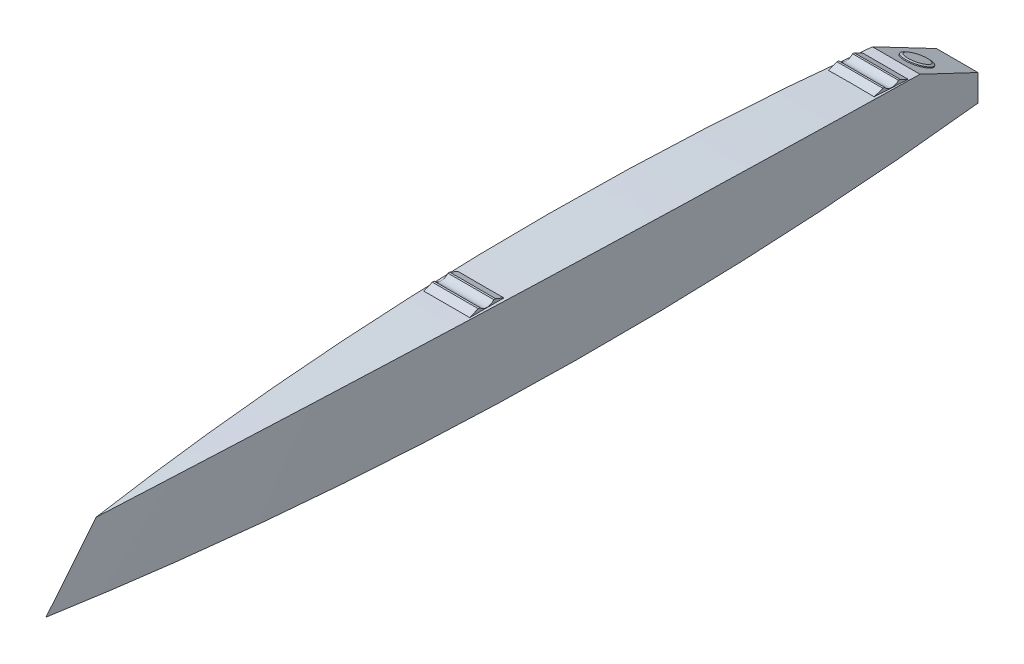
ISO-10303-21;
HEADER;
FILE_DESCRIPTION(('STEP AP214'),'2;1');
FILE_NAME('part.step','',(''),(''),'','','');
FILE_SCHEMA(('AUTOMOTIVE_DESIGN { 1 0 10303 214 1 1 1 1 }'));
ENDSEC;
DATA;
#1=APPLICATION_CONTEXT('core data for automotive mechanical design processes');
#2=APPLICATION_PROTOCOL_DEFINITION('international standard','automotive_design',2000,#1);
#3=PRODUCT_CONTEXT('',#1,'mechanical');
#4=PRODUCT('Part','Part','',(#3));
#5=PRODUCT_RELATED_PRODUCT_CATEGORY('part','',(#4));
#6=PRODUCT_DEFINITION_FORMATION('','',#4);
#7=PRODUCT_DEFINITION_CONTEXT('part definition',#1,'design');
#8=PRODUCT_DEFINITION('design','',#6,#7);
#9=PRODUCT_DEFINITION_SHAPE('','',#8);
#10=(LENGTH_UNIT() NAMED_UNIT(*) SI_UNIT(.MILLI.,.METRE.));
#11=(NAMED_UNIT(*) PLANE_ANGLE_UNIT() SI_UNIT($,.RADIAN.));
#12=(NAMED_UNIT(*) SI_UNIT($,.STERADIAN.) SOLID_ANGLE_UNIT());
#13=UNCERTAINTY_MEASURE_WITH_UNIT(LENGTH_MEASURE(1.E-05),#10,'distance_accuracy_value','');
#14=(GEOMETRIC_REPRESENTATION_CONTEXT(3) GLOBAL_UNCERTAINTY_ASSIGNED_CONTEXT((#13)) GLOBAL_UNIT_ASSIGNED_CONTEXT((#10,
#11,#12)) REPRESENTATION_CONTEXT('',''));
#15=CARTESIAN_POINT('',(0.,0.,0.));
#16=DIRECTION('',(0.,0.,1.));
#17=DIRECTION('',(1.,0.,0.));
#18=AXIS2_PLACEMENT_3D('',#15,#16,#17);
#19=CARTESIAN_POINT('',(130.,452.000000000002,-2367.2199674094));
#20=DIRECTION('',(-1.,0.,0.));
#21=DIRECTION('',(0.,0.,1.));
#22=AXIS2_PLACEMENT_3D('',#19,#20,#21);
#23=CYLINDRICAL_SURFACE('',#22,50.9999999999999);
#24=CARTESIAN_POINT('',(-130.,452.000000000002,-2367.2199674094));
#25=DIRECTION('',(-1.,0.,0.));
#26=DIRECTION('',(0.,0.,-1.));
#27=AXIS2_PLACEMENT_3D('',#24,#25,#26);
#28=CIRCLE('',#27,50.9999999999999);
#29=CARTESIAN_POINT('',(-130.,419.413616232792,-2406.45168408069));
#30=VERTEX_POINT('',#29);
#31=CARTESIAN_POINT('',(-130.,419.505404729545,-2327.9121911023));
#32=VERTEX_POINT('',#31);
#33=EDGE_CURVE('E154',#30,#32,#28,.T.);
#34=ORIENTED_EDGE('',*,*,#33,.T.);
#35=DIRECTION('',(-1.,0.,0.));
#36=VECTOR('',#35,1.);
#37=CARTESIAN_POINT('',(130.,419.505404729545,-2327.9121911023));
#38=LINE('',#37,#36);
#39=CARTESIAN_POINT('',(130.,419.505404729545,-2327.9121911023));
#40=VERTEX_POINT('',#39);
#41=EDGE_CURVE('E12',#40,#32,#38,.T.);
#42=ORIENTED_EDGE('',*,*,#41,.F.);
#43=CARTESIAN_POINT('',(130.,452.000000000002,-2367.2199674094));
#44=DIRECTION('',(-1.,0.,0.));
#45=DIRECTION('',(0.,0.,-1.));
#46=AXIS2_PLACEMENT_3D('',#43,#44,#45);
#47=CIRCLE('',#46,50.9999999999999);
#48=CARTESIAN_POINT('',(130.,419.413616232792,-2406.45168408069));
#49=VERTEX_POINT('',#48);
#50=EDGE_CURVE('E168',#49,#40,#47,.T.);
#51=ORIENTED_EDGE('',*,*,#50,.F.);
#52=DIRECTION('',(-1.,0.,0.));
#53=VECTOR('',#52,1.);
#54=CARTESIAN_POINT('',(130.,419.413616232792,-2406.45168408069));
#55=LINE('',#54,#53);
#56=EDGE_CURVE('E150',#49,#30,#55,.T.);
#57=ORIENTED_EDGE('',*,*,#56,.T.);
#58=EDGE_LOOP('',(#34,#42,#51,#57));
#59=FACE_BOUND('',#58,.T.);
#60=ADVANCED_FACE('F58',(#59),#23,.F.);
#61=CARTESIAN_POINT('',(130.,419.505404729545,-2327.9121911023));
#62=DIRECTION('',(0.,-0.999999317079912,0.00116869145196931));
#63=DIRECTION('',(0.,-0.00116869145196931,-0.999999317079912));
#64=AXIS2_PLACEMENT_3D('',#61,#62,#63);
#65=PLANE('',#64);
#66=DIRECTION('',(0.,0.00116869145196931,0.999999317079912));
#67=VECTOR('',#66,1.);
#68=CARTESIAN_POINT('',(-130.,419.505404729545,-2327.9121911023));
#69=LINE('',#68,#67);
#70=CARTESIAN_POINT('',(-130.,419.517091644065,-2317.9121979315));
#71=VERTEX_POINT('',#70);
#72=EDGE_CURVE('E157',#32,#71,#69,.T.);
#73=ORIENTED_EDGE('',*,*,#72,.T.);
#74=DIRECTION('',(-1.,0.,0.));
#75=VECTOR('',#74,1.);
#76=CARTESIAN_POINT('',(130.,419.517091644065,-2317.9121979315));
#77=LINE('',#76,#75);
#78=CARTESIAN_POINT('',(130.,419.517091644065,-2317.9121979315));
#79=VERTEX_POINT('',#78);
#80=EDGE_CURVE('E66',#79,#71,#77,.T.);
#81=ORIENTED_EDGE('',*,*,#80,.F.);
#82=DIRECTION('',(0.,0.00116869145196931,0.999999317079912));
#83=VECTOR('',#82,1.);
#84=CARTESIAN_POINT('',(130.,419.505404729545,-2327.9121911023));
#85=LINE('',#84,#83);
#86=EDGE_CURVE('E117',#40,#79,#85,.T.);
#87=ORIENTED_EDGE('',*,*,#86,.F.);
#88=ORIENTED_EDGE('',*,*,#41,.T.);
#89=EDGE_LOOP('',(#73,#81,#87,#88));
#90=FACE_BOUND('',#89,.T.);
#91=ADVANCED_FACE('F203',(#90),#65,.F.);
#92=CARTESIAN_POINT('',(130.,419.517091644065,-2317.9121979315));
#93=DIRECTION('',(0.,-0.925955656220427,-0.377632258570953));
#94=DIRECTION('',(0.,0.377632258570953,-0.925955656220427));
#95=AXIS2_PLACEMENT_3D('',#92,#93,#94);
#96=PLANE('',#95);
#97=DIRECTION('',(0.,-0.377632258570953,0.925955656220427));
#98=VECTOR('',#97,1.);
#99=CARTESIAN_POINT('',(-130.,419.517091644065,-2317.9121979315));
#100=LINE('',#99,#98);
#101=CARTESIAN_POINT('',(-130.,398.507173378865,-2266.39580278028));
#102=VERTEX_POINT('',#101);
#103=EDGE_CURVE('E159',#71,#102,#100,.T.);
#104=ORIENTED_EDGE('',*,*,#103,.T.);
#105=DIRECTION('',(-1.,0.,0.));
#106=VECTOR('',#105,1.);
#107=CARTESIAN_POINT('',(130.,398.507173378865,-2266.39580278028));
#108=LINE('',#107,#106);
#109=CARTESIAN_POINT('',(130.,398.507173378865,-2266.39580278028));
#110=VERTEX_POINT('',#109);
#111=EDGE_CURVE('E175',#110,#102,#108,.T.);
#112=ORIENTED_EDGE('',*,*,#111,.F.);
#113=DIRECTION('',(0.,-0.377632258570953,0.925955656220427));
#114=VECTOR('',#113,1.);
#115=CARTESIAN_POINT('',(130.,419.517091644065,-2317.9121979315));
#116=LINE('',#115,#114);
#117=EDGE_CURVE('E183',#79,#110,#116,.T.);
#118=ORIENTED_EDGE('',*,*,#117,.F.);
#119=ORIENTED_EDGE('',*,*,#80,.T.);
#120=EDGE_LOOP('',(#104,#112,#118,#119));
#121=FACE_BOUND('',#120,.T.);
#122=ADVANCED_FACE('F181',(#121),#96,.F.);
#123=CARTESIAN_POINT('',(130.,398.507173378865,-2266.39580278028));
#124=DIRECTION('',(0.,-0.00116869145155625,-0.999999317079912));
#125=DIRECTION('',(0.,0.999999317079913,-0.00116869145155625));
#126=AXIS2_PLACEMENT_3D('',#123,#124,#125);
#127=PLANE('',#126);
#128=DIRECTION('',(0.,-0.999999317079912,0.00116869145155625));
#129=VECTOR('',#128,1.);
#130=CARTESIAN_POINT('',(-130.,398.507173378865,-2266.39580278028));
#131=LINE('',#130,#129);
#132=CARTESIAN_POINT('',(-130.,393.515237661271,-2266.38996874369));
#133=VERTEX_POINT('',#132);
#134=EDGE_CURVE('E161',#102,#133,#131,.T.);
#135=ORIENTED_EDGE('',*,*,#134,.T.);
#136=DIRECTION('',(-1.,0.,0.));
#137=VECTOR('',#136,1.);
#138=CARTESIAN_POINT('',(130.,393.515237661271,-2266.38996874369));
#139=LINE('',#138,#137);
#140=CARTESIAN_POINT('',(130.,393.515237661271,-2266.38996874369));
#141=VERTEX_POINT('',#140);
#142=EDGE_CURVE('E172',#141,#133,#139,.T.);
#143=ORIENTED_EDGE('',*,*,#142,.F.);
#144=DIRECTION('',(0.,-0.999999317079912,0.00116869145155625));
#145=VECTOR('',#144,1.);
#146=CARTESIAN_POINT('',(130.,398.507173378865,-2266.39580278028));
#147=LINE('',#146,#145);
#148=EDGE_CURVE('E195',#110,#141,#147,.T.);
#149=ORIENTED_EDGE('',*,*,#148,.F.);
#150=ORIENTED_EDGE('',*,*,#111,.T.);
#151=EDGE_LOOP('',(#135,#143,#149,#150));
#152=FACE_BOUND('',#151,.T.);
#153=ADVANCED_FACE('F191',(#152),#127,.F.);
#154=CARTESIAN_POINT('',(130.,393.515237661271,-2266.38996874369));
#155=DIRECTION('',(0.,0.999999317079912,-0.00116869145197068));
#156=DIRECTION('',(0.,0.00116869145197068,0.999999317079912));
#157=AXIS2_PLACEMENT_3D('',#154,#155,#156);
#158=PLANE('',#157);
#159=DIRECTION('',(0.,-0.00116869145197068,-0.999999317079912));
#160=VECTOR('',#159,1.);
#161=CARTESIAN_POINT('',(-130.,393.515237661271,-2266.38996874369));
#162=LINE('',#161,#160);
#163=CARTESIAN_POINT('',(-130.,393.281499370877,-2466.38983215968));
#164=VERTEX_POINT('',#163);
#165=EDGE_CURVE('E163',#133,#164,#162,.T.);
#166=ORIENTED_EDGE('',*,*,#165,.T.);
#167=DIRECTION('',(-1.,0.,0.));
#168=VECTOR('',#167,1.);
#169=CARTESIAN_POINT('',(130.,393.281499370877,-2466.38983215968));
#170=LINE('',#169,#168);
#171=CARTESIAN_POINT('',(130.,393.281499370877,-2466.38983215968));
#172=VERTEX_POINT('',#171);
#173=EDGE_CURVE('E145',#172,#164,#170,.T.);
#174=ORIENTED_EDGE('',*,*,#173,.F.);
#175=DIRECTION('',(0.,-0.00116869145197068,-0.999999317079912));
#176=VECTOR('',#175,1.);
#177=CARTESIAN_POINT('',(130.,393.515237661271,-2266.38996874369));
#178=LINE('',#177,#176);
#179=EDGE_CURVE('E136',#141,#172,#178,.T.);
#180=ORIENTED_EDGE('',*,*,#179,.F.);
#181=ORIENTED_EDGE('',*,*,#142,.T.);
#182=EDGE_LOOP('',(#166,#174,#180,#181));
#183=FACE_BOUND('',#182,.T.);
#184=ADVANCED_FACE('F194',(#183),#158,.F.);
#185=CARTESIAN_POINT('',(130.,398.273435088473,-2466.39566619626));
#186=DIRECTION('',(0.,0.00116869145200072,0.999999317079912));
#187=DIRECTION('',(0.,-0.999999317079912,0.00116869145200072));
#188=AXIS2_PLACEMENT_3D('',#185,#186,#187);
#189=PLANE('',#188);
#190=DIRECTION('',(0.,0.999999317079912,-0.00116869145200072));
#191=VECTOR('',#190,1.);
#192=CARTESIAN_POINT('',(-130.,398.273435088473,-2466.39566619626));
#193=LINE('',#192,#191);
#194=CARTESIAN_POINT('',(-130.,398.273435088473,-2466.39566619626));
#195=VERTEX_POINT('',#194);
#196=EDGE_CURVE('E144',#164,#195,#193,.T.);
#197=ORIENTED_EDGE('',*,*,#196,.T.);
#198=DIRECTION('',(-1.,0.,0.));
#199=VECTOR('',#198,1.);
#200=CARTESIAN_POINT('',(130.,398.273435088473,-2466.39566619626));
#201=LINE('',#200,#199);
#202=CARTESIAN_POINT('',(130.,398.273435088473,-2466.39566619626));
#203=VERTEX_POINT('',#202);
#204=EDGE_CURVE('E141',#203,#195,#201,.T.);
#205=ORIENTED_EDGE('',*,*,#204,.F.);
#206=DIRECTION('',(0.,0.999999317079912,-0.00116869145200072));
#207=VECTOR('',#206,1.);
#208=CARTESIAN_POINT('',(130.,398.273435088473,-2466.39566619626));
#209=LINE('',#208,#207);
#210=EDGE_CURVE('E130',#172,#203,#209,.T.);
#211=ORIENTED_EDGE('',*,*,#210,.F.);
#212=ORIENTED_EDGE('',*,*,#173,.T.);
#213=EDGE_LOOP('',(#197,#205,#211,#212));
#214=FACE_BOUND('',#213,.T.);
#215=ADVANCED_FACE('F142',(#214),#189,.F.);
#216=CARTESIAN_POINT('',(130.,419.401909645947,-2416.46851001997));
#217=DIRECTION('',(0.,-0.920931193328839,0.389725207234432));
#218=DIRECTION('',(0.,-0.389725207234432,-0.920931193328839));
#219=AXIS2_PLACEMENT_3D('',#216,#217,#218);
#220=PLANE('',#219);
#221=DIRECTION('',(0.,0.389725207234432,0.920931193328839));
#222=VECTOR('',#221,1.);
#223=CARTESIAN_POINT('',(-130.,419.401909645947,-2416.46851001997));
#224=LINE('',#223,#222);
#225=CARTESIAN_POINT('',(-130.,419.401909645947,-2416.46851001997));
#226=VERTEX_POINT('',#225);
#227=EDGE_CURVE('E103',#195,#226,#224,.T.);
#228=ORIENTED_EDGE('',*,*,#227,.T.);
#229=DIRECTION('',(-1.,0.,0.));
#230=VECTOR('',#229,1.);
#231=CARTESIAN_POINT('',(130.,419.401909645947,-2416.46851001997));
#232=LINE('',#231,#230);
#233=CARTESIAN_POINT('',(130.,419.401909645947,-2416.46851001997));
#234=VERTEX_POINT('',#233);
#235=EDGE_CURVE('E146',#234,#226,#232,.T.);
#236=ORIENTED_EDGE('',*,*,#235,.F.);
#237=DIRECTION('',(0.,0.389725207234432,0.920931193328839));
#238=VECTOR('',#237,1.);
#239=CARTESIAN_POINT('',(130.,419.401909645947,-2416.46851001997));
#240=LINE('',#239,#238);
#241=EDGE_CURVE('E134',#203,#234,#240,.T.);
#242=ORIENTED_EDGE('',*,*,#241,.F.);
#243=ORIENTED_EDGE('',*,*,#204,.T.);
#244=EDGE_LOOP('',(#228,#236,#242,#243));
#245=FACE_BOUND('',#244,.T.);
#246=ADVANCED_FACE('F148',(#245),#220,.F.);
#247=CARTESIAN_POINT('',(130.,419.413616232792,-2406.45168408069));
#248=DIRECTION('',(0.,-0.999999317079912,0.00116869145197264));
#249=DIRECTION('',(0.,-0.00116869145197264,-0.999999317079912));
#250=AXIS2_PLACEMENT_3D('',#247,#248,#249);
#251=PLANE('',#250);
#252=DIRECTION('',(0.,0.00116869145197264,0.999999317079912));
#253=VECTOR('',#252,1.);
#254=CARTESIAN_POINT('',(-130.,419.413616232792,-2406.45168408069));
#255=LINE('',#254,#253);
#256=EDGE_CURVE('E109',#226,#30,#255,.T.);
#257=ORIENTED_EDGE('',*,*,#256,.T.);
#258=ORIENTED_EDGE('',*,*,#56,.F.);
#259=DIRECTION('',(0.,0.00116869145197264,0.999999317079912));
#260=VECTOR('',#259,1.);
#261=CARTESIAN_POINT('',(130.,419.413616232792,-2406.45168408069));
#262=LINE('',#261,#260);
#263=EDGE_CURVE('E74',#234,#49,#262,.T.);
#264=ORIENTED_EDGE('',*,*,#263,.F.);
#265=ORIENTED_EDGE('',*,*,#235,.T.);
#266=EDGE_LOOP('',(#257,#258,#264,#265));
#267=FACE_BOUND('',#266,.T.);
#268=ADVANCED_FACE('F219',(#267),#251,.F.);
#269=CARTESIAN_POINT('',(130.,452.000000000002,-2367.2199674094));
#270=DIRECTION('',(1.,0.,0.));
#271=DIRECTION('',(0.,0.,-1.));
#272=AXIS2_PLACEMENT_3D('',#269,#270,#271);
#273=PLANE('',#272);
#274=ORIENTED_EDGE('',*,*,#50,.T.);
#275=ORIENTED_EDGE('',*,*,#86,.T.);
#276=ORIENTED_EDGE('',*,*,#117,.T.);
#277=ORIENTED_EDGE('',*,*,#148,.T.);
#278=ORIENTED_EDGE('',*,*,#179,.T.);
#279=ORIENTED_EDGE('',*,*,#210,.T.);
#280=ORIENTED_EDGE('',*,*,#241,.T.);
#281=ORIENTED_EDGE('',*,*,#263,.T.);
#282=EDGE_LOOP('',(#274,#275,#276,#277,#278,#279,#280,#281));
#283=FACE_BOUND('',#282,.T.);
#284=ADVANCED_FACE('F132',(#283),#273,.T.);
#285=CARTESIAN_POINT('',(-130.,452.000000000002,-2367.2199674094));
#286=DIRECTION('',(1.,0.,0.));
#287=DIRECTION('',(0.,0.,-1.));
#288=AXIS2_PLACEMENT_3D('',#285,#286,#287);
#289=PLANE('',#288);
#290=ORIENTED_EDGE('',*,*,#33,.F.);
#291=ORIENTED_EDGE('',*,*,#256,.F.);
#292=ORIENTED_EDGE('',*,*,#227,.F.);
#293=ORIENTED_EDGE('',*,*,#196,.F.);
#294=ORIENTED_EDGE('',*,*,#165,.F.);
#295=ORIENTED_EDGE('',*,*,#134,.F.);
#296=ORIENTED_EDGE('',*,*,#103,.F.);
#297=ORIENTED_EDGE('',*,*,#72,.F.);
#298=EDGE_LOOP('',(#290,#291,#292,#293,#294,#295,#296,#297));
#299=FACE_BOUND('',#298,.T.);
#300=ADVANCED_FACE('F187',(#299),#289,.F.);
#301=CLOSED_SHELL('',(#60,#91,#122,#153,#184,#215,#246,#268,#284,#300));
#302=MANIFOLD_SOLID_BREP('B2',#301);
#303=CARTESIAN_POINT('',(130.,384.135187442793,-4661.2163421268));
#304=DIRECTION('',(-1.,0.,0.));
#305=DIRECTION('',(0.,0.,1.));
#306=AXIS2_PLACEMENT_3D('',#303,#304,#305);
#307=CYLINDRICAL_SURFACE('',#306,51.);
#308=CARTESIAN_POINT('',(-130.,384.135187442793,-4661.2163421268));
#309=DIRECTION('',(-1.,0.,0.));
#310=DIRECTION('',(0.,0.,-1.));
#311=AXIS2_PLACEMENT_3D('',#308,#309,#310);
#312=CIRCLE('',#311,51.);
#313=CARTESIAN_POINT('',(-130.,349.373718303237,-4698.53443778105));
#314=VERTEX_POINT('',#313);
#315=CARTESIAN_POINT('',(-130.,353.924998461992,-4620.12687289508));
#316=VERTEX_POINT('',#315);
#317=EDGE_CURVE('E371',#314,#316,#312,.T.);
#318=ORIENTED_EDGE('',*,*,#317,.T.);
#319=DIRECTION('',(-1.,0.,0.));
#320=VECTOR('',#319,1.);
#321=CARTESIAN_POINT('',(130.,353.924998461992,-4620.12687289508));
#322=LINE('',#321,#320);
#323=CARTESIAN_POINT('',(130.,353.924998461992,-4620.12687289508));
#324=VERTEX_POINT('',#323);
#325=EDGE_CURVE('E56',#324,#316,#322,.T.);
#326=ORIENTED_EDGE('',*,*,#325,.F.);
#327=CARTESIAN_POINT('',(130.,384.135187442793,-4661.2163421268));
#328=DIRECTION('',(-1.,0.,0.));
#329=DIRECTION('',(0.,0.,-1.));
#330=AXIS2_PLACEMENT_3D('',#327,#328,#329);
#331=CIRCLE('',#330,51.);
#332=CARTESIAN_POINT('',(130.,349.373718303237,-4698.53443778105));
#333=VERTEX_POINT('',#332);
#334=EDGE_CURVE('E385',#333,#324,#331,.T.);
#335=ORIENTED_EDGE('',*,*,#334,.F.);
#336=DIRECTION('',(-1.,0.,0.));
#337=VECTOR('',#336,1.);
#338=CARTESIAN_POINT('',(130.,349.373718303237,-4698.53443778105));
#339=LINE('',#338,#337);
#340=EDGE_CURVE('E367',#333,#314,#339,.T.);
#341=ORIENTED_EDGE('',*,*,#340,.T.);
#342=EDGE_LOOP('',(#318,#326,#335,#341));
#343=FACE_BOUND('',#342,.T.);
#344=ADVANCED_FACE('F275',(#343),#307,.F.);
#345=CARTESIAN_POINT('',(130.,353.924998461992,-4620.12687289508));
#346=DIRECTION('',(0.,-0.998319550667832,0.0579488977839872));
#347=DIRECTION('',(0.,-0.0579488977839872,-0.998319550667832));
#348=AXIS2_PLACEMENT_3D('',#345,#346,#347);
#349=PLANE('',#348);
#350=DIRECTION('',(0.,0.0579488977839872,0.998319550667831));
#351=VECTOR('',#350,1.);
#352=CARTESIAN_POINT('',(-130.,353.924998461992,-4620.12687289508));
#353=LINE('',#352,#351);
#354=CARTESIAN_POINT('',(-130.,354.504487439832,-4610.1436773884));
#355=VERTEX_POINT('',#354);
#356=EDGE_CURVE('E374',#316,#355,#353,.T.);
#357=ORIENTED_EDGE('',*,*,#356,.T.);
#358=DIRECTION('',(-1.,0.,0.));
#359=VECTOR('',#358,1.);
#360=CARTESIAN_POINT('',(130.,354.504487439832,-4610.1436773884));
#361=LINE('',#360,#359);
#362=CARTESIAN_POINT('',(130.,354.504487439832,-4610.1436773884));
#363=VERTEX_POINT('',#362);
#364=EDGE_CURVE('E283',#363,#355,#361,.T.);
#365=ORIENTED_EDGE('',*,*,#364,.F.);
#366=DIRECTION('',(0.,0.0579488977839872,0.998319550667831));
#367=VECTOR('',#366,1.);
#368=CARTESIAN_POINT('',(130.,353.924998461992,-4620.12687289508));
#369=LINE('',#368,#367);
#370=EDGE_CURVE('E334',#324,#363,#369,.T.);
#371=ORIENTED_EDGE('',*,*,#370,.F.);
#372=ORIENTED_EDGE('',*,*,#325,.T.);
#373=EDGE_LOOP('',(#357,#365,#371,#372));
#374=FACE_BOUND('',#373,.T.);
#375=ADVANCED_FACE('F420',(#374),#349,.F.);
#376=CARTESIAN_POINT('',(130.,354.504487439832,-4610.1436773884));
#377=DIRECTION('',(0.,-0.945904477396131,-0.324445249066698));
#378=DIRECTION('',(0.,0.324445249066698,-0.945904477396131));
#379=AXIS2_PLACEMENT_3D('',#376,#377,#378);
#380=PLANE('',#379);
#381=DIRECTION('',(0.,-0.324445249066698,0.945904477396131));
#382=VECTOR('',#381,1.);
#383=CARTESIAN_POINT('',(-130.,354.504487439832,-4610.1436773884));
#384=LINE('',#383,#382);
#385=CARTESIAN_POINT('',(-130.,336.453677399876,-4557.51741121087));
#386=VERTEX_POINT('',#385);
#387=EDGE_CURVE('E376',#355,#386,#384,.T.);
#388=ORIENTED_EDGE('',*,*,#387,.T.);
#389=DIRECTION('',(-1.,0.,0.));
#390=VECTOR('',#389,1.);
#391=CARTESIAN_POINT('',(130.,336.453677399876,-4557.51741121087));
#392=LINE('',#391,#390);
#393=CARTESIAN_POINT('',(130.,336.453677399876,-4557.51741121087));
#394=VERTEX_POINT('',#393);
#395=EDGE_CURVE('E392',#394,#386,#392,.T.);
#396=ORIENTED_EDGE('',*,*,#395,.F.);
#397=DIRECTION('',(0.,-0.324445249066698,0.945904477396131));
#398=VECTOR('',#397,1.);
#399=CARTESIAN_POINT('',(130.,354.504487439832,-4610.1436773884));
#400=LINE('',#399,#398);
#401=EDGE_CURVE('E400',#363,#394,#400,.T.);
#402=ORIENTED_EDGE('',*,*,#401,.F.);
#403=ORIENTED_EDGE('',*,*,#364,.T.);
#404=EDGE_LOOP('',(#388,#396,#402,#403));
#405=FACE_BOUND('',#404,.T.);
#406=ADVANCED_FACE('F398',(#405),#380,.F.);
#407=CARTESIAN_POINT('',(130.,336.453677399876,-4557.51741121087));
#408=DIRECTION('',(0.,-0.0579488977836595,-0.99831955066785));
#409=DIRECTION('',(0.,0.998319550667851,-0.0579488977836595));
#410=AXIS2_PLACEMENT_3D('',#407,#408,#409);
#411=PLANE('',#410);
#412=DIRECTION('',(0.,-0.99831955066785,0.0579488977836595));
#413=VECTOR('',#412,1.);
#414=CARTESIAN_POINT('',(-130.,336.453677399876,-4557.51741121087));
#415=LINE('',#414,#413);
#416=CARTESIAN_POINT('',(-130.,331.470126973958,-4557.22813384067));
#417=VERTEX_POINT('',#416);
#418=EDGE_CURVE('E378',#386,#417,#415,.T.);
#419=ORIENTED_EDGE('',*,*,#418,.T.);
#420=DIRECTION('',(-1.,0.,0.));
#421=VECTOR('',#420,1.);
#422=CARTESIAN_POINT('',(130.,331.470126973958,-4557.22813384067));
#423=LINE('',#422,#421);
#424=CARTESIAN_POINT('',(130.,331.470126973958,-4557.22813384067));
#425=VERTEX_POINT('',#424);
#426=EDGE_CURVE('E389',#425,#417,#423,.T.);
#427=ORIENTED_EDGE('',*,*,#426,.F.);
#428=DIRECTION('',(0.,-0.99831955066785,0.0579488977836595));
#429=VECTOR('',#428,1.);
#430=CARTESIAN_POINT('',(130.,336.453677399876,-4557.51741121087));
#431=LINE('',#430,#429);
#432=EDGE_CURVE('E412',#394,#425,#431,.T.);
#433=ORIENTED_EDGE('',*,*,#432,.F.);
#434=ORIENTED_EDGE('',*,*,#395,.T.);
#435=EDGE_LOOP('',(#419,#427,#433,#434));
#436=FACE_BOUND('',#435,.T.);
#437=ADVANCED_FACE('F408',(#436),#411,.F.);
#438=CARTESIAN_POINT('',(130.,331.470126973958,-4557.22813384067));
#439=DIRECTION('',(0.,0.998319550667831,-0.0579488977839888));
#440=DIRECTION('',(0.,0.0579488977839888,0.998319550667832));
#441=AXIS2_PLACEMENT_3D('',#438,#439,#440);
#442=PLANE('',#441);
#443=DIRECTION('',(0.,-0.0579488977839888,-0.998319550667831));
#444=VECTOR('',#443,1.);
#445=CARTESIAN_POINT('',(-130.,331.470126973958,-4557.22813384067));
#446=LINE('',#445,#444);
#447=CARTESIAN_POINT('',(-130.,319.88034741716,-4756.89204397424));
#448=VERTEX_POINT('',#447);
#449=EDGE_CURVE('E380',#417,#448,#446,.T.);
#450=ORIENTED_EDGE('',*,*,#449,.T.);
#451=DIRECTION('',(-1.,0.,0.));
#452=VECTOR('',#451,1.);
#453=CARTESIAN_POINT('',(130.,319.88034741716,-4756.89204397424));
#454=LINE('',#453,#452);
#455=CARTESIAN_POINT('',(130.,319.88034741716,-4756.89204397424));
#456=VERTEX_POINT('',#455);
#457=EDGE_CURVE('E362',#456,#448,#454,.T.);
#458=ORIENTED_EDGE('',*,*,#457,.F.);
#459=DIRECTION('',(0.,-0.0579488977839888,-0.998319550667831));
#460=VECTOR('',#459,1.);
#461=CARTESIAN_POINT('',(130.,331.470126973958,-4557.22813384067));
#462=LINE('',#461,#460);
#463=EDGE_CURVE('E353',#425,#456,#462,.T.);
#464=ORIENTED_EDGE('',*,*,#463,.F.);
#465=ORIENTED_EDGE('',*,*,#426,.T.);
#466=EDGE_LOOP('',(#450,#458,#464,#465));
#467=FACE_BOUND('',#466,.T.);
#468=ADVANCED_FACE('F411',(#467),#442,.F.);
#469=CARTESIAN_POINT('',(130.,324.86389784308,-4757.18132134443));
#470=DIRECTION('',(0.,0.0579488977839994,0.998319550667831));
#471=DIRECTION('',(0.,-0.998319550667831,0.0579488977839994));
#472=AXIS2_PLACEMENT_3D('',#469,#470,#471);
#473=PLANE('',#472);
#474=DIRECTION('',(0.,0.998319550667831,-0.0579488977839994));
#475=VECTOR('',#474,1.);
#476=CARTESIAN_POINT('',(-130.,324.86389784308,-4757.18132134443));
#477=LINE('',#476,#475);
#478=CARTESIAN_POINT('',(-130.,324.86389784308,-4757.18132134443));
#479=VERTEX_POINT('',#478);
#480=EDGE_CURVE('E361',#448,#479,#477,.T.);
#481=ORIENTED_EDGE('',*,*,#480,.T.);
#482=DIRECTION('',(-1.,0.,0.));
#483=VECTOR('',#482,1.);
#484=CARTESIAN_POINT('',(130.,324.86389784308,-4757.18132134443));
#485=LINE('',#484,#483);
#486=CARTESIAN_POINT('',(130.,324.86389784308,-4757.18132134443));
#487=VERTEX_POINT('',#486);
#488=EDGE_CURVE('E358',#487,#479,#485,.T.);
#489=ORIENTED_EDGE('',*,*,#488,.F.);
#490=DIRECTION('',(0.,0.998319550667831,-0.0579488977839994));
#491=VECTOR('',#490,1.);
#492=CARTESIAN_POINT('',(130.,324.86389784308,-4757.18132134443));
#493=LINE('',#492,#491);
#494=EDGE_CURVE('E347',#456,#487,#493,.T.);
#495=ORIENTED_EDGE('',*,*,#494,.F.);
#496=ORIENTED_EDGE('',*,*,#457,.T.);
#497=EDGE_LOOP('',(#481,#489,#495,#496));
#498=FACE_BOUND('',#497,.T.);
#499=ADVANCED_FACE('F359',(#498),#473,.F.);
#500=CARTESIAN_POINT('',(130.,348.793253884351,-4708.53443778107));
#501=DIRECTION('',(0.,-0.897315929101801,0.441388857335764));
#502=DIRECTION('',(0.,-0.441388857335764,-0.897315929101801));
#503=AXIS2_PLACEMENT_3D('',#500,#501,#502);
#504=PLANE('',#503);
#505=DIRECTION('',(0.,0.441388857335764,0.897315929101801));
#506=VECTOR('',#505,1.);
#507=CARTESIAN_POINT('',(-130.,348.793253884351,-4708.53443778107));
#508=LINE('',#507,#506);
#509=CARTESIAN_POINT('',(-130.,348.793253884351,-4708.53443778107));
#510=VERTEX_POINT('',#509);
#511=EDGE_CURVE('E320',#479,#510,#508,.T.);
#512=ORIENTED_EDGE('',*,*,#511,.T.);
#513=DIRECTION('',(-1.,0.,0.));
#514=VECTOR('',#513,1.);
#515=CARTESIAN_POINT('',(130.,348.793253884351,-4708.53443778107));
#516=LINE('',#515,#514);
#517=CARTESIAN_POINT('',(130.,348.793253884351,-4708.53443778107));
#518=VERTEX_POINT('',#517);
#519=EDGE_CURVE('E363',#518,#510,#516,.T.);
#520=ORIENTED_EDGE('',*,*,#519,.F.);
#521=DIRECTION('',(0.,0.441388857335764,0.897315929101801));
#522=VECTOR('',#521,1.);
#523=CARTESIAN_POINT('',(130.,348.793253884351,-4708.53443778107));
#524=LINE('',#523,#522);
#525=EDGE_CURVE('E351',#487,#518,#524,.T.);
#526=ORIENTED_EDGE('',*,*,#525,.F.);
#527=ORIENTED_EDGE('',*,*,#488,.T.);
#528=EDGE_LOOP('',(#512,#520,#526,#527));
#529=FACE_BOUND('',#528,.T.);
#530=ADVANCED_FACE('F365',(#529),#504,.F.);
#531=CARTESIAN_POINT('',(130.,349.373718303237,-4698.53443778105));
#532=DIRECTION('',(0.,-0.998319550667831,0.0579488977839903));
#533=DIRECTION('',(0.,-0.0579488977839903,-0.998319550667832));
#534=AXIS2_PLACEMENT_3D('',#531,#532,#533);
#535=PLANE('',#534);
#536=DIRECTION('',(0.,0.0579488977839903,0.998319550667831));
#537=VECTOR('',#536,1.);
#538=CARTESIAN_POINT('',(-130.,349.373718303237,-4698.53443778105));
#539=LINE('',#538,#537);
#540=EDGE_CURVE('E326',#510,#314,#539,.T.);
#541=ORIENTED_EDGE('',*,*,#540,.T.);
#542=ORIENTED_EDGE('',*,*,#340,.F.);
#543=DIRECTION('',(0.,0.0579488977839903,0.998319550667831));
#544=VECTOR('',#543,1.);
#545=CARTESIAN_POINT('',(130.,349.373718303237,-4698.53443778105));
#546=LINE('',#545,#544);
#547=EDGE_CURVE('E291',#518,#333,#546,.T.);
#548=ORIENTED_EDGE('',*,*,#547,.F.);
#549=ORIENTED_EDGE('',*,*,#519,.T.);
#550=EDGE_LOOP('',(#541,#542,#548,#549));
#551=FACE_BOUND('',#550,.T.);
#552=ADVANCED_FACE('F436',(#551),#535,.F.);
#553=CARTESIAN_POINT('',(130.,384.135187442793,-4661.2163421268));
#554=DIRECTION('',(1.,0.,0.));
#555=DIRECTION('',(0.,0.,-1.));
#556=AXIS2_PLACEMENT_3D('',#553,#554,#555);
#557=PLANE('',#556);
#558=ORIENTED_EDGE('',*,*,#334,.T.);
#559=ORIENTED_EDGE('',*,*,#370,.T.);
#560=ORIENTED_EDGE('',*,*,#401,.T.);
#561=ORIENTED_EDGE('',*,*,#432,.T.);
#562=ORIENTED_EDGE('',*,*,#463,.T.);
#563=ORIENTED_EDGE('',*,*,#494,.T.);
#564=ORIENTED_EDGE('',*,*,#525,.T.);
#565=ORIENTED_EDGE('',*,*,#547,.T.);
#566=EDGE_LOOP('',(#558,#559,#560,#561,#562,#563,#564,#565));
#567=FACE_BOUND('',#566,.T.);
#568=ADVANCED_FACE('F349',(#567),#557,.T.);
#569=CARTESIAN_POINT('',(-130.,384.135187442793,-4661.2163421268));
#570=DIRECTION('',(1.,0.,0.));
#571=DIRECTION('',(0.,0.,-1.));
#572=AXIS2_PLACEMENT_3D('',#569,#570,#571);
#573=PLANE('',#572);
#574=ORIENTED_EDGE('',*,*,#317,.F.);
#575=ORIENTED_EDGE('',*,*,#540,.F.);
#576=ORIENTED_EDGE('',*,*,#511,.F.);
#577=ORIENTED_EDGE('',*,*,#480,.F.);
#578=ORIENTED_EDGE('',*,*,#449,.F.);
#579=ORIENTED_EDGE('',*,*,#418,.F.);
#580=ORIENTED_EDGE('',*,*,#387,.F.);
#581=ORIENTED_EDGE('',*,*,#356,.F.);
#582=EDGE_LOOP('',(#574,#575,#576,#577,#578,#579,#580,#581));
#583=FACE_BOUND('',#582,.T.);
#584=ADVANCED_FACE('F404',(#583),#573,.F.);
#585=CLOSED_SHELL('',(#344,#375,#406,#437,#468,#499,#530,#552,#568,#584));
#586=MANIFOLD_SOLID_BREP('B6',#585);
#587=CARTESIAN_POINT('',(0.,0.,-5161.2163421268));
#588=DIRECTION('',(0.,0.,1.));
#589=DIRECTION('',(1.,0.,0.));
#590=AXIS2_PLACEMENT_3D('',#587,#588,#589);
#591=PLANE('',#590);
#592=DIRECTION('',(0.,-1.,0.));
#593=VECTOR('',#592,1.);
#594=CARTESIAN_POINT('',(-117.499999999999,150.,-5161.21634212679));
#595=LINE('',#594,#593);
#596=CARTESIAN_POINT('',(-117.499999999999,150.000000000004,-5161.21634212679));
#597=VERTEX_POINT('',#596);
#598=CARTESIAN_POINT('',(-117.500000000001,-3.38669555531155E-13,-5161.21634212679));
#599=VERTEX_POINT('',#598);
#600=EDGE_CURVE('E549',#597,#599,#595,.T.);
#601=ORIENTED_EDGE('',*,*,#600,.F.);
#602=DIRECTION('',(1.,0.,0.));
#603=VECTOR('',#602,1.);
#604=CARTESIAN_POINT('',(0.,149.999999999999,-5161.2163421268));
#605=LINE('',#604,#603);
#606=CARTESIAN_POINT('',(117.500000000001,149.999999999999,-5161.2163421268));
#607=VERTEX_POINT('',#606);
#608=EDGE_CURVE('E499',#597,#607,#605,.T.);
#609=ORIENTED_EDGE('',*,*,#608,.T.);
#610=DIRECTION('',(0.,-1.,0.));
#611=VECTOR('',#610,1.);
#612=CARTESIAN_POINT('',(117.499999999999,150.,-5161.21634212679));
#613=LINE('',#612,#611);
#614=CARTESIAN_POINT('',(117.500000000001,-3.38669555531155E-13,-5161.21634212679));
#615=VERTEX_POINT('',#614);
#616=EDGE_CURVE('E522',#607,#615,#613,.T.);
#617=ORIENTED_EDGE('',*,*,#616,.T.);
#618=DIRECTION('',(1.,0.,0.));
#619=VECTOR('',#618,1.);
#620=CARTESIAN_POINT('',(0.,-6.7733911106231E-13,-5161.21634212678));
#621=LINE('',#620,#619);
#622=EDGE_CURVE('E573',#599,#615,#621,.T.);
#623=ORIENTED_EDGE('',*,*,#622,.F.);
#624=EDGE_LOOP('',(#601,#609,#617,#623));
#625=FACE_BOUND('',#624,.T.);
#626=ADVANCED_FACE('F483',(#625),#591,.F.);
#627=CARTESIAN_POINT('',(-117.499999999998,300.000000000001,-5161.2163421268));
#628=CARTESIAN_POINT('',(117.499999999998,300.000000000001,-5161.2163421268));
#629=CARTESIAN_POINT('',(-140.009553137715,328.688370974569,-4754.28488456932));
#630=CARTESIAN_POINT('',(140.009553137715,328.688370974569,-4754.28488456932));
#631=CARTESIAN_POINT('',(-154.405820916539,351.174834849115,-4347.48695462651));
#632=CARTESIAN_POINT('',(154.405820916539,351.174834849115,-4347.48695462651));
#633=CARTESIAN_POINT('',(-167.071796696776,383.830262518299,-3534.15660253687));
#634=CARTESIAN_POINT('',(167.071796696776,383.830262518299,-3534.15660253687));
#635=CARTESIAN_POINT('',(-165.341454523587,393.999190667525,-3127.62418124287));
#636=CARTESIAN_POINT('',(165.341454523587,393.999190667525,-3127.62418124287));
#637=CARTESIAN_POINT('',(-145.777544332357,402.071409326704,-2314.82480230965));
#638=CARTESIAN_POINT('',(145.777544332357,402.071409326704,-2314.82480230965));
#639=CARTESIAN_POINT('',(-127.943986130589,399.974679975577,-1908.55784423551));
#640=CARTESIAN_POINT('',(127.943986130589,399.974679975577,-1908.55784423551));
#641=CARTESIAN_POINT('',(-76.1211242861768,383.533927845505,-1096.2908403766));
#642=CARTESIAN_POINT('',(76.1211242861768,383.533927845505,-1096.2908403766));
#643=CARTESIAN_POINT('',(-42.1318909468354,369.189900198871,-690.290792849319));
#644=CARTESIAN_POINT('',(42.1318909468354,369.189900198871,-690.290792849319));
#645=CARTESIAN_POINT('',(3.5527136788005E-12,348.71482297531,-284.425688427215));
#646=CARTESIAN_POINT('',(-3.5527136788005E-12,348.71482297531,-284.425688427215));
#647=B_SPLINE_SURFACE_WITH_KNOTS('',3,1,((#627,#628),(#629,#630),(#631,#632),(#633,#634),(#635,
#636),(#637,#638),(#639,#640),(#641,#642),(#643,#644),(#645,#646)),.UNSPECIFIED.,.F.,.F.,.F.,(4,
2,2,2,4),(2,2),(0.,0.25,0.5,0.75,1.),(0.,1.),.UNSPECIFIED.);
#648=CARTESIAN_POINT('',(-134.676555989066,322.887198360408,-4815.44194540598));
#649=CARTESIAN_POINT('',(-106.831256539604,322.887198360409,-4815.44194540598));
#650=CARTESIAN_POINT('',(-78.9859570901409,322.887198360409,-4815.44194540598));
#651=CARTESIAN_POINT('',(-23.2953581912156,322.887198360409,-4815.44194540598));
#652=CARTESIAN_POINT('',(4.54994125824701,322.887198360409,-4815.44194540598));
#653=CARTESIAN_POINT('',(66.4890124681619,322.887198360409,-4815.44194540598));
#654=CARTESIAN_POINT('',(100.582784228614,322.887198360409,-4815.44194540598));
#655=CARTESIAN_POINT('',(134.676555989066,322.887198360409,-4815.44194540598));
#656=B_SPLINE_CURVE_WITH_KNOTS('',3,(#648,#649,#650,#651,#652,#653,#654,#655),.UNSPECIFIED.,.F.,
.F.,(4,2,2,4),(0.,83.5358983483879,167.071796696776,269.353111978133),.UNSPECIFIED.);
#657=CARTESIAN_POINT('',(-134.676555989066,322.887198360408,-4815.44194540598));
#658=VERTEX_POINT('',#657);
#659=CARTESIAN_POINT('',(134.676555989066,322.887198360408,-4815.44194540598));
#660=VERTEX_POINT('',#659);
#661=EDGE_CURVE('E533',#658,#660,#656,.T.);
#662=CARTESIAN_POINT('',(-117.499999999998,300.000000000001,-5161.2163421268));
#663=CARTESIAN_POINT('',(-140.009553137715,328.688370974569,-4754.28488456932));
#664=CARTESIAN_POINT('',(-154.405820916539,351.174834849115,-4347.48695462651));
#665=CARTESIAN_POINT('',(-167.071796696776,383.830262518299,-3534.15660253687));
#666=CARTESIAN_POINT('',(-165.341454523587,393.999190667525,-3127.62418124287));
#667=CARTESIAN_POINT('',(-145.777544332357,402.071409326704,-2314.82480230965));
#668=CARTESIAN_POINT('',(-127.943986130589,399.974679975577,-1908.55784423551));
#669=CARTESIAN_POINT('',(-76.1211242861768,383.533927845505,-1096.2908403766));
#670=CARTESIAN_POINT('',(-42.1318909468354,369.189900198871,-690.290792849319));
#671=CARTESIAN_POINT('',(3.5527136788005E-12,348.71482297531,-284.425688427215));
#672=B_SPLINE_CURVE_WITH_KNOTS('',3,(#662,#663,#664,#665,#666,#667,#668,#669,#670,#671),
.UNSPECIFIED.,.F.,.F.,(4,2,2,2,4),(0.,0.25,0.5,0.75,1.),.UNSPECIFIED.);
#673=CARTESIAN_POINT('',(-1.77635683940025E-12,348.71482297531,-284.425688427215));
#674=VERTEX_POINT('',#673);
#675=EDGE_CURVE('E543',#674,#658,#672,.F.);
#676=CARTESIAN_POINT('',(117.499999999998,300.000000000001,-5161.2163421268));
#677=CARTESIAN_POINT('',(140.009553137715,328.688370974569,-4754.28488456932));
#678=CARTESIAN_POINT('',(154.405820916539,351.174834849115,-4347.48695462651));
#679=CARTESIAN_POINT('',(167.071796696776,383.830262518299,-3534.15660253687));
#680=CARTESIAN_POINT('',(165.341454523587,393.999190667525,-3127.62418124287));
#681=CARTESIAN_POINT('',(145.777544332357,402.071409326704,-2314.82480230965));
#682=CARTESIAN_POINT('',(127.943986130589,399.974679975577,-1908.55784423551));
#683=CARTESIAN_POINT('',(76.1211242861768,383.533927845505,-1096.2908403766));
#684=CARTESIAN_POINT('',(42.1318909468354,369.189900198871,-690.290792849319));
#685=CARTESIAN_POINT('',(-3.5527136788005E-12,348.71482297531,-284.425688427215));
#686=B_SPLINE_CURVE_WITH_KNOTS('',3,(#676,#677,#678,#679,#680,#681,#682,#683,#684,#685),
.UNSPECIFIED.,.F.,.F.,(4,2,2,2,4),(0.,0.25,0.5,0.75,1.),.UNSPECIFIED.);
#687=EDGE_CURVE('E508',#674,#660,#686,.F.);
#688=ORIENTED_EDGE('',*,*,#661,.F.);
#689=ORIENTED_EDGE('',*,*,#675,.F.);
#690=ORIENTED_EDGE('',*,*,#687,.T.);
#691=EDGE_LOOP('',(#688,#689,#690));
#692=FACE_BOUND('',#691,.T.);
#693=ADVANCED_FACE('F542',(#692),#647,.T.);
#694=CARTESIAN_POINT('',(117.500000000001,-6.7733911106231E-13,-5161.21634212678));
#695=CARTESIAN_POINT('',(117.499999999998,300.000000000001,-5161.2163421268));
#696=CARTESIAN_POINT('',(138.305187825377,-28.6058472623804,-4730.41841378295));
#697=CARTESIAN_POINT('',(140.009553137715,328.688370974569,-4754.28488456932));
#698=CARTESIAN_POINT('',(151.432202389036,-50.0134928910894,-4299.79528635783));
#699=CARTESIAN_POINT('',(154.405820916539,351.174834849115,-4347.48695462651));
#700=CARTESIAN_POINT('',(162.387804270332,-78.5143371332878,-3438.89731475755));
#701=CARTESIAN_POINT('',(167.071796696776,383.830262518299,-3534.15660253687));
#702=CARTESIAN_POINT('',(160.216391587969,-85.6075357467773,-3008.6224705824));
#703=CARTESIAN_POINT('',(165.341454523587,393.999190667525,-3127.62418124287));
#704=CARTESIAN_POINT('',(140.633058254636,-85.5614422106589,-2148.41974689461));
#705=CARTESIAN_POINT('',(145.777544332357,402.071409326704,-2314.82480230965));
#706=CARTESIAN_POINT('',(123.221137603665,-78.4219901832272,-1718.49186738196));
#707=CARTESIAN_POINT('',(127.943986130589,399.974679975577,-1908.55784423551));
#708=CARTESIAN_POINT('',(73.0988690557015,-49.8979392951456,-858.984391606649));
#709=CARTESIAN_POINT('',(76.1211242861768,383.533927845505,-1096.2908403766));
#710=CARTESIAN_POINT('',(40.3885211587092,-28.5133404344957,-429.404795343973));
#711=CARTESIAN_POINT('',(42.1318909468354,369.189900198871,-690.290792849319));
#712=CARTESIAN_POINT('',(0.,0.,-5.32907051820075E-12));
#713=CARTESIAN_POINT('',(-3.5527136788005E-12,348.71482297531,-284.425688427215));
#714=B_SPLINE_SURFACE_WITH_KNOTS('',3,1,((#694,#695),(#696,#697),(#698,#699),(#700,#701),(#702,
#703),(#704,#705),(#706,#707),(#708,#709),(#710,#711),(#712,#713)),.UNSPECIFIED.,.F.,.F.,.F.,(4,
2,2,2,4),(2,2),(0.,0.25,0.5,0.75,1.),(0.,1.),.UNSPECIFIED.);
#715=CARTESIAN_POINT('',(117.499999999999,150.000000000004,-5161.21634212679));
#716=CARTESIAN_POINT('',(117.996581034036,154.80203629666,-5151.61226953348));
#717=CARTESIAN_POINT('',(118.492245720091,159.604091583193,-5142.00815896041));
#718=CARTESIAN_POINT('',(119.481360961995,169.208245323621,-5122.79985147955));
#719=CARTESIAN_POINT('',(119.974811518963,174.010343777492,-5113.19565457181));
#720=CARTESIAN_POINT('',(120.959117339963,183.614591638156,-5093.98715885049));
#721=CARTESIAN_POINT('',(121.449972605213,188.416741044923,-5084.38286003695));
#722=CARTESIAN_POINT('',(122.428727753437,198.021098137734,-5065.17414585133));
#723=CARTESIAN_POINT('',(122.916627637619,202.823305823754,-5055.56973047929));
#724=CARTESIAN_POINT('',(123.889126329725,212.427786516037,-5036.36076909472));
#725=CARTESIAN_POINT('',(124.373725138709,217.23005952228,-5026.75622308224));
#726=CARTESIAN_POINT('',(125.339291163878,226.834677584557,-5007.54698695768));
#727=CARTESIAN_POINT('',(125.820258380805,231.637022640577,-4997.94229684564));
#728=CARTESIAN_POINT('',(126.778244863133,241.24179300054,-4978.73275612572));
#729=CARTESIAN_POINT('',(127.255264127322,246.044218304507,-4969.12790551778));
#730=CARTESIAN_POINT('',(128.205051331308,255.649153245877,-4949.91803563504));
#731=CARTESIAN_POINT('',(128.677819270895,260.451662883284,-4940.31301636023));
#732=CARTESIAN_POINT('',(129.618813194928,270.056772125207,-4921.10279787638));
#733=CARTESIAN_POINT('',(130.087039178471,274.859371729741,-4911.49759866732));
#734=CARTESIAN_POINT('',(131.018670683676,284.464666301312,-4892.28700952417));
#735=CARTESIAN_POINT('',(131.482076203497,289.267361268386,-4882.68161959003));
#736=CARTESIAN_POINT('',(132.40379882194,298.872851767701,-4863.4706385914));
#737=CARTESIAN_POINT('',(132.862115917511,303.675647300002,-4853.8650475268));
#738=CARTESIAN_POINT('',(133.773407043489,313.281343830266,-4834.65365446627));
#739=CARTESIAN_POINT('',(134.226381069347,318.084244828316,-4825.04785247017));
#740=CARTESIAN_POINT('',(134.676555989066,322.887198360409,-4815.44194540598));
#741=B_SPLINE_CURVE_WITH_KNOTS('',3,(#715,#716,#717,#718,#719,#720,#721,#722,#723,#724,#725,
#726,#727,#728,#729,#730,#731,#732,#733,#734,#735,#736,#737,#738,#739,#740),.UNSPECIFIED.,.F.,
.F.,(4,2,2,2,2,2,2,2,2,2,2,2,4),(0.,32.2474682252958,64.4949201490906,96.7423569165177,
128.989780489205,161.237193704785,193.484600324214,225.732016838856,257.979434943813,
290.22685945099,322.474296272581,354.721752425158,386.969236029506),.UNSPECIFIED.);
#742=EDGE_CURVE('E526',#607,#660,#741,.T.);
#743=DIRECTION('',(0.,0.774921828834034,-0.632057085393808));
#744=VECTOR('',#743,1.);
#745=CARTESIAN_POINT('',(1.77635683940025E-12,174.357411487655,-142.21284421361));
#746=LINE('',#745,#744);
#747=CARTESIAN_POINT('',(0.,0.,-5.32907051820075E-12));
#748=VERTEX_POINT('',#747);
#749=EDGE_CURVE('E547',#748,#674,#746,.T.);
#750=CARTESIAN_POINT('',(117.500000000001,-6.7733911106231E-13,-5161.21634212678));
#751=CARTESIAN_POINT('',(138.305187825377,-28.6058472623804,-4730.41841378295));
#752=CARTESIAN_POINT('',(151.432202389036,-50.0134928910894,-4299.79528635783));
#753=CARTESIAN_POINT('',(162.387804270332,-78.5143371332878,-3438.89731475755));
#754=CARTESIAN_POINT('',(160.216391587969,-85.6075357467773,-3008.6224705824));
#755=CARTESIAN_POINT('',(140.633058254636,-85.5614422106589,-2148.41974689461));
#756=CARTESIAN_POINT('',(123.221137603665,-78.4219901832272,-1718.49186738196));
#757=CARTESIAN_POINT('',(73.0988690557015,-49.8979392951456,-858.984391606649));
#758=CARTESIAN_POINT('',(40.3885211587092,-28.5133404344957,-429.404795343973));
#759=CARTESIAN_POINT('',(0.,0.,-5.32907051820075E-12));
#760=B_SPLINE_CURVE_WITH_KNOTS('',3,(#750,#751,#752,#753,#754,#755,#756,#757,#758,#759),
.UNSPECIFIED.,.F.,.F.,(4,2,2,2,4),(0.,0.25,0.5,0.75,1.),.UNSPECIFIED.);
#761=EDGE_CURVE('E558',#615,#748,#760,.T.);
#762=ORIENTED_EDGE('',*,*,#616,.F.);
#763=ORIENTED_EDGE('',*,*,#742,.T.);
#764=ORIENTED_EDGE('',*,*,#687,.F.);
#765=ORIENTED_EDGE('',*,*,#749,.F.);
#766=ORIENTED_EDGE('',*,*,#761,.F.);
#767=EDGE_LOOP('',(#762,#763,#764,#765,#766));
#768=FACE_BOUND('',#767,.T.);
#769=ADVANCED_FACE('F617',(#768),#714,.F.);
#770=CARTESIAN_POINT('',(117.500000000001,-6.7733911106231E-13,-5161.21634212678));
#771=CARTESIAN_POINT('',(-117.500000000001,-6.7733911106231E-13,-5161.21634212678));
#772=CARTESIAN_POINT('',(138.305187825377,-28.6058472623804,-4730.41841378295));
#773=CARTESIAN_POINT('',(-138.305187825377,-28.6058472623804,-4730.41841378295));
#774=CARTESIAN_POINT('',(151.432202389036,-50.0134928910894,-4299.79528635783));
#775=CARTESIAN_POINT('',(-151.432202389036,-50.0134928910894,-4299.79528635783));
#776=CARTESIAN_POINT('',(162.387804270332,-78.5143371332878,-3438.89731475755));
#777=CARTESIAN_POINT('',(-162.387804270332,-78.5143371332878,-3438.89731475755));
#778=CARTESIAN_POINT('',(160.216391587969,-85.6075357467773,-3008.6224705824));
#779=CARTESIAN_POINT('',(-160.216391587969,-85.6075357467773,-3008.6224705824));
#780=CARTESIAN_POINT('',(140.633058254636,-85.5614422106589,-2148.41974689461));
#781=CARTESIAN_POINT('',(-140.633058254636,-85.5614422106589,-2148.41974689461));
#782=CARTESIAN_POINT('',(123.221137603665,-78.4219901832272,-1718.49186738196));
#783=CARTESIAN_POINT('',(-123.221137603665,-78.4219901832272,-1718.49186738196));
#784=CARTESIAN_POINT('',(73.0988690557015,-49.8979392951456,-858.984391606649));
#785=CARTESIAN_POINT('',(-73.0988690557015,-49.8979392951456,-858.984391606649));
#786=CARTESIAN_POINT('',(40.3885211587092,-28.5133404344957,-429.404795343973));
#787=CARTESIAN_POINT('',(-40.3885211587092,-28.5133404344957,-429.404795343973));
#788=CARTESIAN_POINT('',(0.,0.,-5.32907051820075E-12));
#789=CARTESIAN_POINT('',(0.,0.,-5.32907051820075E-12));
#790=B_SPLINE_SURFACE_WITH_KNOTS('',3,1,((#770,#771),(#772,#773),(#774,#775),(#776,#777),(#778,
#779),(#780,#781),(#782,#783),(#784,#785),(#786,#787),(#788,#789)),.UNSPECIFIED.,.F.,.F.,.F.,(4,
2,2,2,4),(2,2),(0.,0.25,0.5,0.75,1.),(0.,1.),.UNSPECIFIED.);
#791=CARTESIAN_POINT('',(-117.500000000001,-6.7733911106231E-13,-5161.21634212678));
#792=CARTESIAN_POINT('',(-138.305187825377,-28.6058472623804,-4730.41841378295));
#793=CARTESIAN_POINT('',(-151.432202389036,-50.0134928910894,-4299.79528635783));
#794=CARTESIAN_POINT('',(-162.387804270332,-78.5143371332878,-3438.89731475755));
#795=CARTESIAN_POINT('',(-160.216391587969,-85.6075357467773,-3008.6224705824));
#796=CARTESIAN_POINT('',(-140.633058254636,-85.5614422106589,-2148.41974689461));
#797=CARTESIAN_POINT('',(-123.221137603665,-78.4219901832272,-1718.49186738196));
#798=CARTESIAN_POINT('',(-73.0988690557015,-49.8979392951456,-858.984391606649));
#799=CARTESIAN_POINT('',(-40.3885211587092,-28.5133404344957,-429.404795343973));
#800=CARTESIAN_POINT('',(0.,0.,-5.32907051820075E-12));
#801=B_SPLINE_CURVE_WITH_KNOTS('',3,(#791,#792,#793,#794,#795,#796,#797,#798,#799,#800),
.UNSPECIFIED.,.F.,.F.,(4,2,2,2,4),(0.,0.25,0.5,0.75,1.),.UNSPECIFIED.);
#802=EDGE_CURVE('E538',#599,#748,#801,.T.);
#803=ORIENTED_EDGE('',*,*,#761,.T.);
#804=ORIENTED_EDGE('',*,*,#802,.F.);
#805=ORIENTED_EDGE('',*,*,#622,.T.);
#806=EDGE_LOOP('',(#803,#804,#805));
#807=FACE_BOUND('',#806,.T.);
#808=ADVANCED_FACE('F631',(#807),#790,.T.);
#809=CARTESIAN_POINT('',(-117.500000000001,-6.7733911106231E-13,-5161.21634212678));
#810=CARTESIAN_POINT('',(-117.499999999998,300.000000000001,-5161.2163421268));
#811=CARTESIAN_POINT('',(-138.305187825377,-28.6058472623804,-4730.41841378295));
#812=CARTESIAN_POINT('',(-140.009553137715,328.688370974569,-4754.28488456932));
#813=CARTESIAN_POINT('',(-151.432202389036,-50.0134928910894,-4299.79528635783));
#814=CARTESIAN_POINT('',(-154.405820916539,351.174834849115,-4347.48695462651));
#815=CARTESIAN_POINT('',(-162.387804270332,-78.5143371332878,-3438.89731475755));
#816=CARTESIAN_POINT('',(-167.071796696776,383.830262518299,-3534.15660253687));
#817=CARTESIAN_POINT('',(-160.216391587969,-85.6075357467773,-3008.6224705824));
#818=CARTESIAN_POINT('',(-165.341454523587,393.999190667525,-3127.62418124287));
#819=CARTESIAN_POINT('',(-140.633058254636,-85.5614422106589,-2148.41974689461));
#820=CARTESIAN_POINT('',(-145.777544332357,402.071409326704,-2314.82480230965));
#821=CARTESIAN_POINT('',(-123.221137603665,-78.4219901832272,-1718.49186738196));
#822=CARTESIAN_POINT('',(-127.943986130589,399.974679975577,-1908.55784423551));
#823=CARTESIAN_POINT('',(-73.0988690557015,-49.8979392951456,-858.984391606649));
#824=CARTESIAN_POINT('',(-76.1211242861768,383.533927845505,-1096.2908403766));
#825=CARTESIAN_POINT('',(-40.3885211587092,-28.5133404344957,-429.404795343973));
#826=CARTESIAN_POINT('',(-42.1318909468354,369.189900198871,-690.290792849319));
#827=CARTESIAN_POINT('',(0.,0.,-5.32907051820075E-12));
#828=CARTESIAN_POINT('',(3.5527136788005E-12,348.71482297531,-284.425688427215));
#829=B_SPLINE_SURFACE_WITH_KNOTS('',3,1,((#809,#810),(#811,#812),(#813,#814),(#815,#816),(#817,
#818),(#819,#820),(#821,#822),(#823,#824),(#825,#826),(#827,#828)),.UNSPECIFIED.,.F.,.F.,.F.,(4,
2,2,2,4),(2,2),(0.,0.25,0.5,0.75,1.),(0.,1.),.UNSPECIFIED.);
#830=CARTESIAN_POINT('',(-134.676555989066,322.887198360408,-4815.44194540598));
#831=CARTESIAN_POINT('',(-134.226381069347,318.084244828316,-4825.04785247017));
#832=CARTESIAN_POINT('',(-133.773407043489,313.281343830266,-4834.65365446627));
#833=CARTESIAN_POINT('',(-132.862115917511,303.675647300002,-4853.8650475268));
#834=CARTESIAN_POINT('',(-132.40379882194,298.872851767701,-4863.4706385914));
#835=CARTESIAN_POINT('',(-131.482076203497,289.267361268386,-4882.68161959003));
#836=CARTESIAN_POINT('',(-131.018670683677,284.464666301313,-4892.28700952417));
#837=CARTESIAN_POINT('',(-130.087039178471,274.859371729741,-4911.49759866732));
#838=CARTESIAN_POINT('',(-129.618813194928,270.056772125207,-4921.10279787638));
#839=CARTESIAN_POINT('',(-128.677819270895,260.451662883283,-4940.31301636023));
#840=CARTESIAN_POINT('',(-128.205051331308,255.649153245876,-4949.91803563504));
#841=CARTESIAN_POINT('',(-127.255264127322,246.044218304507,-4969.12790551778));
#842=CARTESIAN_POINT('',(-126.778244863133,241.24179300054,-4978.73275612572));
#843=CARTESIAN_POINT('',(-125.820258380805,231.637022640577,-4997.94229684564));
#844=CARTESIAN_POINT('',(-125.339291163878,226.834677584557,-5007.54698695768));
#845=CARTESIAN_POINT('',(-124.373725138709,217.23005952228,-5026.75622308224));
#846=CARTESIAN_POINT('',(-123.889126329725,212.427786516038,-5036.36076909472));
#847=CARTESIAN_POINT('',(-122.916627637619,202.823305823754,-5055.56973047929));
#848=CARTESIAN_POINT('',(-122.428727753437,198.021098137734,-5065.17414585133));
#849=CARTESIAN_POINT('',(-121.449972605214,188.416741044922,-5084.38286003695));
#850=CARTESIAN_POINT('',(-120.959117339963,183.614591638155,-5093.98715885049));
#851=CARTESIAN_POINT('',(-119.974811518963,174.010343777492,-5113.19565457181));
#852=CARTESIAN_POINT('',(-119.481360961995,169.208245323621,-5122.79985147955));
#853=CARTESIAN_POINT('',(-118.492245720091,159.604091583193,-5142.00815896041));
#854=CARTESIAN_POINT('',(-117.996581034036,154.80203629666,-5151.61226953348));
#855=CARTESIAN_POINT('',(-117.499999999999,150.000000000004,-5161.21634212679));
#856=B_SPLINE_CURVE_WITH_KNOTS('',3,(#830,#831,#832,#833,#834,#835,#836,#837,#838,#839,#840,
#841,#842,#843,#844,#845,#846,#847,#848,#849,#850,#851,#852,#853,#854,#855),.UNSPECIFIED.,.F.,
.F.,(4,2,2,2,2,2,2,2,2,2,2,2,4),(0.,32.2474836043486,64.4949397569258,96.7423765785168,
128.989801085692,161.237219190651,193.484635705292,225.73204232472,257.979455540301,
290.226879112989,322.474315880415,354.72176780421,386.969236029506),.UNSPECIFIED.);
#857=EDGE_CURVE('E530',#658,#597,#856,.T.);
#858=ORIENTED_EDGE('',*,*,#675,.T.);
#859=ORIENTED_EDGE('',*,*,#857,.T.);
#860=ORIENTED_EDGE('',*,*,#600,.T.);
#861=ORIENTED_EDGE('',*,*,#802,.T.);
#862=ORIENTED_EDGE('',*,*,#749,.T.);
#863=EDGE_LOOP('',(#858,#859,#860,#861,#862));
#864=FACE_BOUND('',#863,.T.);
#865=ADVANCED_FACE('F545',(#864),#829,.T.);
#866=CARTESIAN_POINT('',(-167.071796696776,400.,-4661.2163421268));
#867=DIRECTION('',(0.,-0.894427190999915,0.44721359549996));
#868=DIRECTION('',(0.,-0.44721359549996,-0.894427190999915));
#869=AXIS2_PLACEMENT_3D('',#866,#867,#868);
#870=PLANE('',#869);
#871=CARTESIAN_POINT('',(0.,264.749430945413,-4931.71748023597));
#872=DIRECTION('',(0.,-0.894427190999915,0.44721359549996));
#873=DIRECTION('',(0.,-0.44721359549996,-0.894427190999915));
#874=AXIS2_PLACEMENT_3D('',#871,#872,#873);
#875=CIRCLE('',#874,74.9999999999997);
#876=CARTESIAN_POINT('',(0.,231.208411282916,-4998.79951956096));
#877=VERTEX_POINT('',#876);
#878=EDGE_CURVE('E537',#877,#877,#875,.F.);
#879=ORIENTED_EDGE('',*,*,#878,.F.);
#880=EDGE_LOOP('',(#879));
#881=FACE_BOUND('',#880,.T.);
#882=ORIENTED_EDGE('',*,*,#608,.F.);
#883=ORIENTED_EDGE('',*,*,#857,.F.);
#884=ORIENTED_EDGE('',*,*,#661,.T.);
#885=ORIENTED_EDGE('',*,*,#742,.F.);
#886=EDGE_LOOP('',(#882,#883,#884,#885));
#887=FACE_BOUND('',#886,.T.);
#888=ADVANCED_FACE('F532',(#881,#887),#870,.F.);
#889=CARTESIAN_POINT('',(0.,273.693702855412,-4936.18961619097));
#890=DIRECTION('',(0.,-0.894427190999915,0.44721359549996));
#891=DIRECTION('',(0.,-0.44721359549996,-0.894427190999915));
#892=AXIS2_PLACEMENT_3D('',#889,#890,#891);
#893=CYLINDRICAL_SURFACE('',#892,74.9999999999997);
#894=CARTESIAN_POINT('',(0.,269.221566900412,-4933.95354821347));
#895=DIRECTION('',(0.,0.894427190999918,-0.447213595499953));
#896=DIRECTION('',(0.,0.447213595499953,0.894427190999918));
#897=AXIS2_PLACEMENT_3D('',#894,#895,#896);
#898=CIRCLE('',#897,74.9999999999997);
#899=CARTESIAN_POINT('',(0.,302.762586562909,-4866.87150888848));
#900=VERTEX_POINT('',#899);
#901=EDGE_CURVE('E273',#900,#900,#898,.F.);
#902=ORIENTED_EDGE('',*,*,#901,.T.);
#903=EDGE_LOOP('',(#902));
#904=FACE_BOUND('',#903,.T.);
#905=ORIENTED_EDGE('',*,*,#878,.T.);
#906=EDGE_LOOP('',(#905));
#907=FACE_BOUND('',#906,.T.);
#908=ADVANCED_FACE('F601',(#904,#907),#893,.T.);
#909=CARTESIAN_POINT('',(0.,273.693702855412,-4936.18961619097));
#910=DIRECTION('',(0.,0.894427190999915,-0.44721359549996));
#911=DIRECTION('',(0.,0.44721359549996,0.894427190999915));
#912=AXIS2_PLACEMENT_3D('',#909,#910,#911);
#913=PLANE('',#912);
#914=CARTESIAN_POINT('',(0.,273.693702855412,-4936.18961619097));
#915=DIRECTION('',(0.,0.894427190999915,-0.44721359549996));
#916=DIRECTION('',(0.,0.44721359549996,0.894427190999915));
#917=AXIS2_PLACEMENT_3D('',#914,#915,#916);
#918=CIRCLE('',#917,61.2626129027226);
#919=CARTESIAN_POINT('',(0.,301.091176241361,-4881.39466941907));
#920=VERTEX_POINT('',#919);
#921=EDGE_CURVE('E492',#920,#920,#918,.T.);
#922=ORIENTED_EDGE('',*,*,#921,.T.);
#923=EDGE_LOOP('',(#922));
#924=FACE_BOUND('',#923,.T.);
#925=ADVANCED_FACE('F711',(#924),#913,.T.);
#926=CARTESIAN_POINT('',(0.,273.693702855412,-4936.18961619097));
#927=DIRECTION('',(0.,-0.894427190999918,0.447213595499953));
#928=DIRECTION('',(0.,-0.447213595499953,-0.894427190999918));
#929=AXIS2_PLACEMENT_3D('',#926,#927,#928);
#930=CONICAL_SURFACE('',#929,61.2626129027239,1.22173047639606);
#931=ORIENTED_EDGE('',*,*,#901,.F.);
#932=EDGE_LOOP('',(#931));
#933=FACE_BOUND('',#932,.T.);
#934=ORIENTED_EDGE('',*,*,#921,.F.);
#935=EDGE_LOOP('',(#934));
#936=FACE_BOUND('',#935,.T.);
#937=ADVANCED_FACE('F486',(#933,#936),#930,.T.);
#938=CLOSED_SHELL('',(#626,#693,#769,#808,#865,#888,#908,#925,#937));
#939=MANIFOLD_SOLID_BREP('B50',#938);
#940=ADVANCED_BREP_SHAPE_REPRESENTATION('',(#18,#302,#586,#939),#14);
#941=SHAPE_DEFINITION_REPRESENTATION(#9,#940);
ENDSEC;
END-ISO-10303-21;
